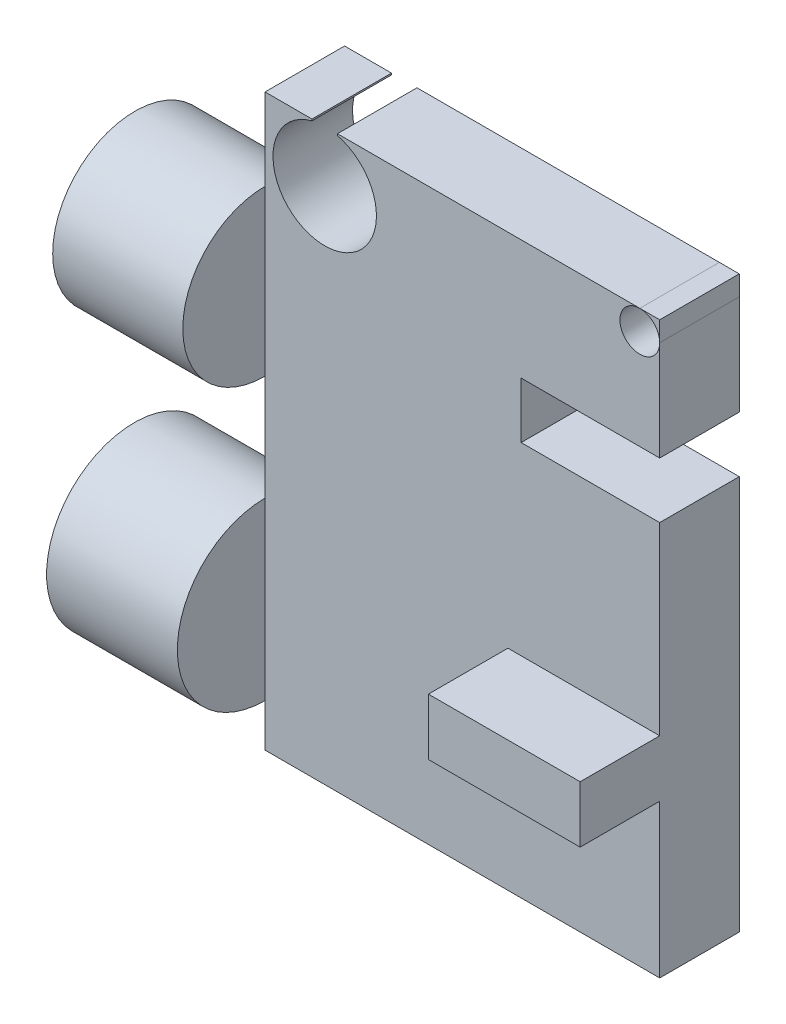
ISO-10303-21;
HEADER;
FILE_DESCRIPTION(('STEP AP214'),'2;1');
FILE_NAME('part.step','',(''),(''),'','','');
FILE_SCHEMA(('AUTOMOTIVE_DESIGN { 1 0 10303 214 1 1 1 1 }'));
ENDSEC;
DATA;
#1=APPLICATION_CONTEXT('core data for automotive mechanical design processes');
#2=APPLICATION_PROTOCOL_DEFINITION('international standard','automotive_design',2000,#1);
#3=PRODUCT_CONTEXT('',#1,'mechanical');
#4=PRODUCT('Part','Part','',(#3));
#5=PRODUCT_RELATED_PRODUCT_CATEGORY('part','',(#4));
#6=PRODUCT_DEFINITION_FORMATION('','',#4);
#7=PRODUCT_DEFINITION_CONTEXT('part definition',#1,'design');
#8=PRODUCT_DEFINITION('design','',#6,#7);
#9=PRODUCT_DEFINITION_SHAPE('','',#8);
#10=(LENGTH_UNIT() NAMED_UNIT(*) SI_UNIT(.MILLI.,.METRE.));
#11=(NAMED_UNIT(*) PLANE_ANGLE_UNIT() SI_UNIT($,.RADIAN.));
#12=(NAMED_UNIT(*) SI_UNIT($,.STERADIAN.) SOLID_ANGLE_UNIT());
#13=UNCERTAINTY_MEASURE_WITH_UNIT(LENGTH_MEASURE(1.E-05),#10,'distance_accuracy_value','');
#14=(GEOMETRIC_REPRESENTATION_CONTEXT(3) GLOBAL_UNCERTAINTY_ASSIGNED_CONTEXT((#13)) GLOBAL_UNIT_ASSIGNED_CONTEXT((#10,
#11,#12)) REPRESENTATION_CONTEXT('',''));
#15=CARTESIAN_POINT('',(0.,0.,0.));
#16=DIRECTION('',(0.,0.,1.));
#17=DIRECTION('',(1.,0.,0.));
#18=AXIS2_PLACEMENT_3D('',#15,#16,#17);
#19=CARTESIAN_POINT('',(-49.610297337926,71.6556088207095,10.));
#20=DIRECTION('',(0.,-1.,0.));
#21=DIRECTION('',(0.,0.,-1.));
#22=AXIS2_PLACEMENT_3D('',#19,#20,#21);
#23=PLANE('',#22);
#24=DIRECTION('',(0.,0.,1.));
#25=VECTOR('',#24,1.);
#26=CARTESIAN_POINT('',(-2.5,71.6556088207095,-1.02191726886024));
#27=LINE('',#26,#25);
#28=CARTESIAN_POINT('',(-2.5,71.6556088207095,0.));
#29=VERTEX_POINT('',#28);
#30=CARTESIAN_POINT('',(-2.5,71.6556088207095,10.));
#31=VERTEX_POINT('',#30);
#32=EDGE_CURVE('E187',#29,#31,#27,.T.);
#33=ORIENTED_EDGE('',*,*,#32,.F.);
#34=DIRECTION('',(-1.,0.,0.));
#35=VECTOR('',#34,1.);
#36=CARTESIAN_POINT('',(-49.610297337926,71.6556088207095,0.));
#37=LINE('',#36,#35);
#38=CARTESIAN_POINT('',(-40.5102973379259,71.6556088207095,0.));
#39=VERTEX_POINT('',#38);
#40=EDGE_CURVE('E221',#29,#39,#37,.T.);
#41=ORIENTED_EDGE('',*,*,#40,.T.);
#42=DIRECTION('',(0.,0.,1.));
#43=VECTOR('',#42,1.);
#44=CARTESIAN_POINT('',(-40.5102973379259,71.6556088207095,-1.02191726886024));
#45=LINE('',#44,#43);
#46=CARTESIAN_POINT('',(-40.5102973379259,71.6556088207095,10.));
#47=VERTEX_POINT('',#46);
#48=EDGE_CURVE('E212',#39,#47,#45,.T.);
#49=ORIENTED_EDGE('',*,*,#48,.T.);
#50=DIRECTION('',(-1.,0.,0.));
#51=VECTOR('',#50,1.);
#52=CARTESIAN_POINT('',(-49.610297337926,71.6556088207095,10.));
#53=LINE('',#52,#51);
#54=EDGE_CURVE('E211',#31,#47,#53,.T.);
#55=ORIENTED_EDGE('',*,*,#54,.F.);
#56=EDGE_LOOP('',(#33,#41,#49,#55));
#57=FACE_BOUND('',#56,.T.);
#58=ADVANCED_FACE('F51',(#57),#23,.F.);
#59=CARTESIAN_POINT('',(0.,0.,10.));
#60=DIRECTION('',(0.,0.,-1.));
#61=DIRECTION('',(-1.,0.,0.));
#62=AXIS2_PLACEMENT_3D('',#59,#60,#61);
#63=PLANE('',#62);
#64=DIRECTION('',(0.,1.,0.));
#65=VECTOR('',#64,1.);
#66=CARTESIAN_POINT('',(0.,71.6556088207095,10.));
#67=LINE('',#66,#65);
#68=CARTESIAN_POINT('',(0.,56.6036307667019,10.));
#69=VERTEX_POINT('',#68);
#70=CARTESIAN_POINT('',(0.,69.1556088207095,10.));
#71=VERTEX_POINT('',#70);
#72=EDGE_CURVE('E200',#69,#71,#67,.T.);
#73=ORIENTED_EDGE('',*,*,#72,.T.);
#74=CARTESIAN_POINT('',(-2.5,69.1556088207095,10.));
#75=DIRECTION('',(0.,0.,1.));
#76=DIRECTION('',(1.,0.,0.));
#77=AXIS2_PLACEMENT_3D('',#74,#75,#76);
#78=CIRCLE('',#77,2.5);
#79=EDGE_CURVE('E55',#31,#71,#78,.T.);
#80=ORIENTED_EDGE('',*,*,#79,.F.);
#81=ORIENTED_EDGE('',*,*,#54,.T.);
#82=DIRECTION('',(0.,1.,0.));
#83=VECTOR('',#82,1.);
#84=CARTESIAN_POINT('',(-40.5102973379259,71.6556088207095,10.));
#85=LINE('',#84,#83);
#86=CARTESIAN_POINT('',(-40.5102973379259,71.4556088207095,10.));
#87=VERTEX_POINT('',#86);
#88=EDGE_CURVE('E363',#87,#47,#85,.T.);
#89=ORIENTED_EDGE('',*,*,#88,.F.);
#90=CARTESIAN_POINT('',(-42.110297337926,65.1556088207095,10.));
#91=DIRECTION('',(0.,0.,1.));
#92=DIRECTION('',(1.,0.,0.));
#93=AXIS2_PLACEMENT_3D('',#90,#91,#92);
#94=CIRCLE('',#93,6.50000000000001);
#95=CARTESIAN_POINT('',(-43.710297337926,71.4556088207095,10.));
#96=VERTEX_POINT('',#95);
#97=EDGE_CURVE('E359',#96,#87,#94,.T.);
#98=ORIENTED_EDGE('',*,*,#97,.F.);
#99=DIRECTION('',(0.,-1.,0.));
#100=VECTOR('',#99,1.);
#101=CARTESIAN_POINT('',(-43.710297337926,71.6556088207095,10.));
#102=LINE('',#101,#100);
#103=CARTESIAN_POINT('',(-43.710297337926,71.6556088207095,10.));
#104=VERTEX_POINT('',#103);
#105=EDGE_CURVE('E354',#104,#96,#102,.T.);
#106=ORIENTED_EDGE('',*,*,#105,.F.);
#107=CARTESIAN_POINT('',(-49.610297337926,71.6556088207095,10.));
#108=VERTEX_POINT('',#107);
#109=EDGE_CURVE('E218',#104,#108,#53,.T.);
#110=ORIENTED_EDGE('',*,*,#109,.T.);
#111=DIRECTION('',(0.,-1.,0.));
#112=VECTOR('',#111,1.);
#113=CARTESIAN_POINT('',(-49.610297337926,0.,10.));
#114=LINE('',#113,#112);
#115=CARTESIAN_POINT('',(-49.610297337926,61.3830462195706,10.));
#116=VERTEX_POINT('',#115);
#117=EDGE_CURVE('E242',#108,#116,#114,.T.);
#118=ORIENTED_EDGE('',*,*,#117,.T.);
#119=CARTESIAN_POINT('',(-49.610297337926,40.7047589540983,10.));
#120=VERTEX_POINT('',#119);
#121=EDGE_CURVE('E249',#116,#120,#114,.T.);
#122=ORIENTED_EDGE('',*,*,#121,.T.);
#123=CARTESIAN_POINT('',(-49.610297337926,27.439442595116,10.));
#124=VERTEX_POINT('',#123);
#125=EDGE_CURVE('E241',#120,#124,#114,.T.);
#126=ORIENTED_EDGE('',*,*,#125,.T.);
#127=DIRECTION('',(0.,-1.,0.));
#128=VECTOR('',#127,1.);
#129=CARTESIAN_POINT('',(-49.610297337926,0.,10.));
#130=LINE('',#129,#128);
#131=CARTESIAN_POINT('',(-49.610297337926,5.3956080573955,10.));
#132=VERTEX_POINT('',#131);
#133=EDGE_CURVE('E239',#124,#132,#130,.T.);
#134=ORIENTED_EDGE('',*,*,#133,.T.);
#135=CARTESIAN_POINT('',(-49.610297337926,0.,10.));
#136=VERTEX_POINT('',#135);
#137=EDGE_CURVE('E234',#132,#136,#114,.T.);
#138=ORIENTED_EDGE('',*,*,#137,.T.);
#139=DIRECTION('',(1.,0.,0.));
#140=VECTOR('',#139,1.);
#141=CARTESIAN_POINT('',(0.,0.,10.));
#142=LINE('',#141,#140);
#143=CARTESIAN_POINT('',(0.,0.,10.));
#144=VERTEX_POINT('',#143);
#145=EDGE_CURVE('E228',#136,#144,#142,.T.);
#146=ORIENTED_EDGE('',*,*,#145,.T.);
#147=CARTESIAN_POINT('',(0.,19.246158961627,10.));
#148=VERTEX_POINT('',#147);
#149=EDGE_CURVE('E215',#144,#148,#67,.T.);
#150=ORIENTED_EDGE('',*,*,#149,.T.);
#151=DIRECTION('',(-1.,0.,0.));
#152=VECTOR('',#151,1.);
#153=CARTESIAN_POINT('',(0.,19.246158961627,10.));
#154=LINE('',#153,#152);
#155=CARTESIAN_POINT('',(-19.0764471627235,19.246158961627,10.));
#156=VERTEX_POINT('',#155);
#157=EDGE_CURVE('E226',#148,#156,#154,.T.);
#158=ORIENTED_EDGE('',*,*,#157,.T.);
#159=DIRECTION('',(0.,-1.,0.));
#160=VECTOR('',#159,1.);
#161=CARTESIAN_POINT('',(-19.0764471627235,0.,10.));
#162=LINE('',#161,#160);
#163=CARTESIAN_POINT('',(-19.0764471627235,26.3665125954924,10.));
#164=VERTEX_POINT('',#163);
#165=EDGE_CURVE('E319',#164,#156,#162,.T.);
#166=ORIENTED_EDGE('',*,*,#165,.F.);
#167=DIRECTION('',(-1.,0.,0.));
#168=VECTOR('',#167,1.);
#169=CARTESIAN_POINT('',(0.,26.3665125954924,10.));
#170=LINE('',#169,#168);
#171=CARTESIAN_POINT('',(0.,26.3665125954924,10.));
#172=VERTEX_POINT('',#171);
#173=EDGE_CURVE('E281',#172,#164,#170,.T.);
#174=ORIENTED_EDGE('',*,*,#173,.F.);
#175=CARTESIAN_POINT('',(0.,49.5808162237113,10.));
#176=VERTEX_POINT('',#175);
#177=EDGE_CURVE('E214',#172,#176,#67,.T.);
#178=ORIENTED_EDGE('',*,*,#177,.T.);
#179=DIRECTION('',(-1.,0.,0.));
#180=VECTOR('',#179,1.);
#181=CARTESIAN_POINT('',(0.,49.5808162237113,10.));
#182=LINE('',#181,#180);
#183=CARTESIAN_POINT('',(-17.4182826178507,49.5808162237113,10.));
#184=VERTEX_POINT('',#183);
#185=EDGE_CURVE('E225',#176,#184,#182,.T.);
#186=ORIENTED_EDGE('',*,*,#185,.T.);
#187=DIRECTION('',(0.,-1.,0.));
#188=VECTOR('',#187,1.);
#189=CARTESIAN_POINT('',(-17.4182826178507,0.,10.));
#190=LINE('',#189,#188);
#191=CARTESIAN_POINT('',(-17.4182826178507,56.6036307667019,10.));
#192=VERTEX_POINT('',#191);
#193=EDGE_CURVE('E282',#192,#184,#190,.T.);
#194=ORIENTED_EDGE('',*,*,#193,.F.);
#195=DIRECTION('',(-1.,0.,0.));
#196=VECTOR('',#195,1.);
#197=CARTESIAN_POINT('',(0.,56.6036307667019,10.));
#198=LINE('',#197,#196);
#199=EDGE_CURVE('E209',#69,#192,#198,.T.);
#200=ORIENTED_EDGE('',*,*,#199,.F.);
#201=EDGE_LOOP('',(#73,#80,#81,#89,#98,#106,#110,#118,#122,#126,#134,#138,#146,#150,#158,#166,
#174,#178,#186,#194,#200));
#202=FACE_BOUND('',#201,.T.);
#203=ADVANCED_FACE('F206',(#202),#63,.F.);
#204=CARTESIAN_POINT('',(0.,71.6556088207095,10.));
#205=DIRECTION('',(-1.,0.,0.));
#206=DIRECTION('',(0.,0.,1.));
#207=AXIS2_PLACEMENT_3D('',#204,#205,#206);
#208=PLANE('',#207);
#209=DIRECTION('',(0.,0.,1.));
#210=VECTOR('',#209,1.);
#211=CARTESIAN_POINT('',(0.,49.5808162237113,0.));
#212=LINE('',#211,#210);
#213=CARTESIAN_POINT('',(0.,49.5808162237113,0.));
#214=VERTEX_POINT('',#213);
#215=EDGE_CURVE('E287',#214,#176,#212,.T.);
#216=ORIENTED_EDGE('',*,*,#215,.T.);
#217=ORIENTED_EDGE('',*,*,#177,.F.);
#218=DIRECTION('',(0.,0.,-1.));
#219=VECTOR('',#218,1.);
#220=CARTESIAN_POINT('',(0.,26.3665125954924,20.));
#221=LINE('',#220,#219);
#222=CARTESIAN_POINT('',(0.,26.3665125954924,20.));
#223=VERTEX_POINT('',#222);
#224=EDGE_CURVE('E328',#223,#172,#221,.T.);
#225=ORIENTED_EDGE('',*,*,#224,.F.);
#226=DIRECTION('',(0.,1.,0.));
#227=VECTOR('',#226,1.);
#228=CARTESIAN_POINT('',(0.,0.,20.));
#229=LINE('',#228,#227);
#230=CARTESIAN_POINT('',(0.,19.246158961627,20.));
#231=VERTEX_POINT('',#230);
#232=EDGE_CURVE('E338',#231,#223,#229,.T.);
#233=ORIENTED_EDGE('',*,*,#232,.F.);
#234=DIRECTION('',(0.,0.,-1.));
#235=VECTOR('',#234,1.);
#236=CARTESIAN_POINT('',(0.,19.246158961627,20.));
#237=LINE('',#236,#235);
#238=EDGE_CURVE('E291',#231,#148,#237,.T.);
#239=ORIENTED_EDGE('',*,*,#238,.T.);
#240=ORIENTED_EDGE('',*,*,#149,.F.);
#241=DIRECTION('',(0.,0.,-1.));
#242=VECTOR('',#241,1.);
#243=CARTESIAN_POINT('',(0.,0.,10.));
#244=LINE('',#243,#242);
#245=CARTESIAN_POINT('',(0.,0.,0.));
#246=VERTEX_POINT('',#245);
#247=EDGE_CURVE('E327',#144,#246,#244,.T.);
#248=ORIENTED_EDGE('',*,*,#247,.T.);
#249=DIRECTION('',(0.,1.,0.));
#250=VECTOR('',#249,1.);
#251=CARTESIAN_POINT('',(0.,71.6556088207095,0.));
#252=LINE('',#251,#250);
#253=EDGE_CURVE('E379',#246,#214,#252,.T.);
#254=ORIENTED_EDGE('',*,*,#253,.T.);
#255=EDGE_LOOP('',(#216,#217,#225,#233,#239,#240,#248,#254));
#256=FACE_BOUND('',#255,.T.);
#257=ADVANCED_FACE('F442',(#256),#208,.F.);
#258=CARTESIAN_POINT('',(-49.610297337926,0.,10.));
#259=DIRECTION('',(1.,0.,0.));
#260=DIRECTION('',(0.,0.,-1.));
#261=AXIS2_PLACEMENT_3D('',#258,#259,#260);
#262=PLANE('',#261);
#263=DIRECTION('',(0.,-1.,0.));
#264=VECTOR('',#263,1.);
#265=CARTESIAN_POINT('',(-49.610297337926,0.,0.));
#266=LINE('',#265,#264);
#267=CARTESIAN_POINT('',(-49.610297337926,48.4175189403828,0.));
#268=VERTEX_POINT('',#267);
#269=CARTESIAN_POINT('',(-49.610297337926,21.0524644069341,0.));
#270=VERTEX_POINT('',#269);
#271=EDGE_CURVE('E270',#268,#270,#266,.T.);
#272=ORIENTED_EDGE('',*,*,#271,.T.);
#273=CARTESIAN_POINT('',(-49.610297337926,16.4175253262557,10.));
#274=DIRECTION('',(1.,0.,0.));
#275=DIRECTION('',(0.,0.,-1.));
#276=AXIS2_PLACEMENT_3D('',#273,#274,#275);
#277=CIRCLE('',#276,11.0219172688602);
#278=EDGE_CURVE('E266',#270,#124,#277,.T.);
#279=ORIENTED_EDGE('',*,*,#278,.T.);
#280=ORIENTED_EDGE('',*,*,#125,.F.);
#281=CARTESIAN_POINT('',(-49.610297337926,51.0439025868344,10.));
#282=DIRECTION('',(-1.,0.,0.));
#283=DIRECTION('',(0.,0.,1.));
#284=AXIS2_PLACEMENT_3D('',#281,#282,#283);
#285=CIRCLE('',#284,10.3391436327362);
#286=EDGE_CURVE('E262',#268,#120,#285,.T.);
#287=ORIENTED_EDGE('',*,*,#286,.F.);
#288=EDGE_LOOP('',(#272,#279,#280,#287));
#289=FACE_BOUND('',#288,.T.);
#290=ADVANCED_FACE('F487',(#289),#262,.F.);
#291=CARTESIAN_POINT('',(-49.610297337926,53.670286233286,0.));
#292=VERTEX_POINT('',#291);
#293=EDGE_CURVE('E256',#116,#292,#285,.T.);
#294=ORIENTED_EDGE('',*,*,#293,.F.);
#295=ORIENTED_EDGE('',*,*,#117,.F.);
#296=DIRECTION('',(0.,0.,-1.));
#297=VECTOR('',#296,1.);
#298=CARTESIAN_POINT('',(-49.610297337926,71.6556088207095,10.));
#299=LINE('',#298,#297);
#300=CARTESIAN_POINT('',(-49.610297337926,71.6556088207095,0.));
#301=VERTEX_POINT('',#300);
#302=EDGE_CURVE('E269',#108,#301,#299,.T.);
#303=ORIENTED_EDGE('',*,*,#302,.T.);
#304=EDGE_CURVE('E244',#301,#292,#266,.T.);
#305=ORIENTED_EDGE('',*,*,#304,.T.);
#306=EDGE_LOOP('',(#294,#295,#303,#305));
#307=FACE_BOUND('',#306,.T.);
#308=ADVANCED_FACE('F488',(#307),#262,.F.);
#309=CARTESIAN_POINT('',(0.,56.6036307667019,0.));
#310=VERTEX_POINT('',#309);
#311=CARTESIAN_POINT('',(0.,69.1556088207095,0.));
#312=VERTEX_POINT('',#311);
#313=EDGE_CURVE('E202',#310,#312,#252,.T.);
#314=ORIENTED_EDGE('',*,*,#313,.T.);
#315=DIRECTION('',(0.,0.,1.));
#316=VECTOR('',#315,1.);
#317=CARTESIAN_POINT('',(0.,69.1556088207095,-1.02191726886024));
#318=LINE('',#317,#316);
#319=EDGE_CURVE('E191',#312,#71,#318,.T.);
#320=ORIENTED_EDGE('',*,*,#319,.T.);
#321=ORIENTED_EDGE('',*,*,#72,.F.);
#322=DIRECTION('',(0.,0.,1.));
#323=VECTOR('',#322,1.);
#324=CARTESIAN_POINT('',(0.,56.6036307667019,0.));
#325=LINE('',#324,#323);
#326=EDGE_CURVE('E292',#310,#69,#325,.T.);
#327=ORIENTED_EDGE('',*,*,#326,.F.);
#328=EDGE_LOOP('',(#314,#320,#321,#327));
#329=FACE_BOUND('',#328,.T.);
#330=ADVANCED_FACE('F198',(#329),#208,.F.);
#331=ORIENTED_EDGE('',*,*,#109,.F.);
#332=DIRECTION('',(0.,0.,1.));
#333=VECTOR('',#332,1.);
#334=CARTESIAN_POINT('',(-43.710297337926,71.6556088207095,-1.02191726886024));
#335=LINE('',#334,#333);
#336=CARTESIAN_POINT('',(-43.710297337926,71.6556088207095,0.));
#337=VERTEX_POINT('',#336);
#338=EDGE_CURVE('E351',#337,#104,#335,.T.);
#339=ORIENTED_EDGE('',*,*,#338,.F.);
#340=EDGE_CURVE('E204',#337,#301,#37,.T.);
#341=ORIENTED_EDGE('',*,*,#340,.T.);
#342=ORIENTED_EDGE('',*,*,#302,.F.);
#343=EDGE_LOOP('',(#331,#339,#341,#342));
#344=FACE_BOUND('',#343,.T.);
#345=ADVANCED_FACE('F475',(#344),#23,.F.);
#346=ORIENTED_EDGE('',*,*,#137,.F.);
#347=CARTESIAN_POINT('',(-49.610297337926,11.7825862455774,0.));
#348=VERTEX_POINT('',#347);
#349=EDGE_CURVE('E387',#132,#348,#277,.T.);
#350=ORIENTED_EDGE('',*,*,#349,.T.);
#351=CARTESIAN_POINT('',(-49.610297337926,0.,0.));
#352=VERTEX_POINT('',#351);
#353=EDGE_CURVE('E395',#348,#352,#266,.T.);
#354=ORIENTED_EDGE('',*,*,#353,.T.);
#355=DIRECTION('',(0.,0.,-1.));
#356=VECTOR('',#355,1.);
#357=CARTESIAN_POINT('',(-49.610297337926,0.,10.));
#358=LINE('',#357,#356);
#359=EDGE_CURVE('E313',#136,#352,#358,.T.);
#360=ORIENTED_EDGE('',*,*,#359,.F.);
#361=EDGE_LOOP('',(#346,#350,#354,#360));
#362=FACE_BOUND('',#361,.T.);
#363=ADVANCED_FACE('F481',(#362),#262,.F.);
#364=CARTESIAN_POINT('',(0.,0.,10.));
#365=DIRECTION('',(0.,1.,0.));
#366=DIRECTION('',(0.,0.,1.));
#367=AXIS2_PLACEMENT_3D('',#364,#365,#366);
#368=PLANE('',#367);
#369=DIRECTION('',(1.,0.,0.));
#370=VECTOR('',#369,1.);
#371=CARTESIAN_POINT('',(0.,0.,0.));
#372=LINE('',#371,#370);
#373=EDGE_CURVE('E400',#352,#246,#372,.T.);
#374=ORIENTED_EDGE('',*,*,#373,.T.);
#375=ORIENTED_EDGE('',*,*,#247,.F.);
#376=ORIENTED_EDGE('',*,*,#145,.F.);
#377=ORIENTED_EDGE('',*,*,#359,.T.);
#378=EDGE_LOOP('',(#374,#375,#376,#377));
#379=FACE_BOUND('',#378,.T.);
#380=ADVANCED_FACE('F437',(#379),#368,.F.);
#381=CARTESIAN_POINT('',(0.,0.,0.));
#382=DIRECTION('',(0.,0.,-1.));
#383=DIRECTION('',(-1.,0.,0.));
#384=AXIS2_PLACEMENT_3D('',#381,#382,#383);
#385=PLANE('',#384);
#386=CARTESIAN_POINT('',(-2.5,69.1556088207095,0.));
#387=DIRECTION('',(0.,0.,-1.));
#388=DIRECTION('',(-1.,0.,0.));
#389=AXIS2_PLACEMENT_3D('',#386,#387,#388);
#390=CIRCLE('',#389,2.5);
#391=EDGE_CURVE('E12',#312,#29,#390,.T.);
#392=ORIENTED_EDGE('',*,*,#391,.F.);
#393=ORIENTED_EDGE('',*,*,#313,.F.);
#394=DIRECTION('',(-1.,0.,0.));
#395=VECTOR('',#394,1.);
#396=CARTESIAN_POINT('',(0.,56.6036307667019,0.));
#397=LINE('',#396,#395);
#398=CARTESIAN_POINT('',(-17.4182826178507,56.6036307667019,0.));
#399=VERTEX_POINT('',#398);
#400=EDGE_CURVE('E309',#310,#399,#397,.T.);
#401=ORIENTED_EDGE('',*,*,#400,.T.);
#402=DIRECTION('',(0.,-1.,0.));
#403=VECTOR('',#402,1.);
#404=CARTESIAN_POINT('',(-17.4182826178507,0.,0.));
#405=LINE('',#404,#403);
#406=CARTESIAN_POINT('',(-17.4182826178507,49.5808162237113,0.));
#407=VERTEX_POINT('',#406);
#408=EDGE_CURVE('E261',#399,#407,#405,.T.);
#409=ORIENTED_EDGE('',*,*,#408,.T.);
#410=DIRECTION('',(-1.,0.,0.));
#411=VECTOR('',#410,1.);
#412=CARTESIAN_POINT('',(0.,49.5808162237113,0.));
#413=LINE('',#412,#411);
#414=EDGE_CURVE('E286',#214,#407,#413,.T.);
#415=ORIENTED_EDGE('',*,*,#414,.F.);
#416=ORIENTED_EDGE('',*,*,#253,.F.);
#417=ORIENTED_EDGE('',*,*,#373,.F.);
#418=ORIENTED_EDGE('',*,*,#353,.F.);
#419=EDGE_CURVE('E277',#270,#348,#266,.T.);
#420=ORIENTED_EDGE('',*,*,#419,.F.);
#421=ORIENTED_EDGE('',*,*,#271,.F.);
#422=EDGE_CURVE('E254',#292,#268,#266,.T.);
#423=ORIENTED_EDGE('',*,*,#422,.F.);
#424=ORIENTED_EDGE('',*,*,#304,.F.);
#425=ORIENTED_EDGE('',*,*,#340,.F.);
#426=DIRECTION('',(0.,1.,0.));
#427=VECTOR('',#426,1.);
#428=CARTESIAN_POINT('',(-43.710297337926,0.,0.));
#429=LINE('',#428,#427);
#430=CARTESIAN_POINT('',(-43.710297337926,71.4556088207095,0.));
#431=VERTEX_POINT('',#430);
#432=EDGE_CURVE('E355',#431,#337,#429,.T.);
#433=ORIENTED_EDGE('',*,*,#432,.F.);
#434=CARTESIAN_POINT('',(-42.110297337926,65.1556088207095,0.));
#435=DIRECTION('',(0.,0.,-1.));
#436=DIRECTION('',(-1.,0.,0.));
#437=AXIS2_PLACEMENT_3D('',#434,#435,#436);
#438=CIRCLE('',#437,6.50000000000001);
#439=CARTESIAN_POINT('',(-40.5102973379259,71.4556088207095,0.));
#440=VERTEX_POINT('',#439);
#441=EDGE_CURVE('E360',#440,#431,#438,.T.);
#442=ORIENTED_EDGE('',*,*,#441,.F.);
#443=DIRECTION('',(0.,-1.,0.));
#444=VECTOR('',#443,1.);
#445=CARTESIAN_POINT('',(-40.5102973379259,0.,0.));
#446=LINE('',#445,#444);
#447=EDGE_CURVE('E341',#39,#440,#446,.T.);
#448=ORIENTED_EDGE('',*,*,#447,.F.);
#449=ORIENTED_EDGE('',*,*,#40,.F.);
#450=EDGE_LOOP('',(#392,#393,#401,#409,#415,#416,#417,#418,#420,#421,#423,#424,#425,#433,#442,
#448,#449));
#451=FACE_BOUND('',#450,.T.);
#452=ADVANCED_FACE('F444',(#451),#385,.T.);
#453=CARTESIAN_POINT('',(-49.610297337926,61.3830462195706,10.));
#454=DIRECTION('',(1.,0.,0.));
#455=DIRECTION('',(0.,0.,-1.));
#456=AXIS2_PLACEMENT_3D('',#453,#454,#455);
#457=PLANE('',#456);
#458=ORIENTED_EDGE('',*,*,#121,.F.);
#459=EDGE_CURVE('E255',#120,#116,#285,.T.);
#460=ORIENTED_EDGE('',*,*,#459,.F.);
#461=EDGE_LOOP('',(#458,#460));
#462=FACE_BOUND('',#461,.T.);
#463=ADVANCED_FACE('F516',(#462),#457,.T.);
#464=CARTESIAN_POINT('',(-65.9666450181579,51.0439025868344,10.));
#465=DIRECTION('',(-1.,0.,0.));
#466=DIRECTION('',(0.,0.,1.));
#467=AXIS2_PLACEMENT_3D('',#464,#465,#466);
#468=CYLINDRICAL_SURFACE('',#467,10.3391436327362);
#469=CARTESIAN_POINT('',(-65.9666450181579,51.0439025868344,10.));
#470=DIRECTION('',(-1.,0.,0.));
#471=DIRECTION('',(0.,0.,1.));
#472=AXIS2_PLACEMENT_3D('',#469,#470,#471);
#473=CIRCLE('',#472,10.3391436327362);
#474=CARTESIAN_POINT('',(-65.9666450181579,51.0439025868344,20.3391436327362));
#475=VERTEX_POINT('',#474);
#476=EDGE_CURVE('E250',#475,#475,#473,.T.);
#477=ORIENTED_EDGE('',*,*,#476,.F.);
#478=EDGE_LOOP('',(#477));
#479=FACE_BOUND('',#478,.T.);
#480=ORIENTED_EDGE('',*,*,#293,.T.);
#481=EDGE_CURVE('E260',#292,#268,#285,.T.);
#482=ORIENTED_EDGE('',*,*,#481,.T.);
#483=ORIENTED_EDGE('',*,*,#286,.T.);
#484=ORIENTED_EDGE('',*,*,#459,.T.);
#485=EDGE_LOOP('',(#480,#482,#483,#484));
#486=FACE_BOUND('',#485,.T.);
#487=ADVANCED_FACE('F512',(#479,#486),#468,.T.);
#488=CARTESIAN_POINT('',(-65.9666450181579,61.3830462195706,10.));
#489=DIRECTION('',(1.,0.,0.));
#490=DIRECTION('',(0.,0.,-1.));
#491=AXIS2_PLACEMENT_3D('',#488,#489,#490);
#492=PLANE('',#491);
#493=ORIENTED_EDGE('',*,*,#476,.T.);
#494=EDGE_LOOP('',(#493));
#495=FACE_BOUND('',#494,.T.);
#496=ADVANCED_FACE('F515',(#495),#492,.F.);
#497=ORIENTED_EDGE('',*,*,#481,.F.);
#498=ORIENTED_EDGE('',*,*,#422,.T.);
#499=EDGE_LOOP('',(#497,#498));
#500=FACE_BOUND('',#499,.T.);
#501=ADVANCED_FACE('F520',(#500),#457,.T.);
#502=CARTESIAN_POINT('',(-49.610297337926,27.439442595116,10.));
#503=DIRECTION('',(1.,0.,0.));
#504=DIRECTION('',(0.,0.,-1.));
#505=AXIS2_PLACEMENT_3D('',#502,#503,#504);
#506=PLANE('',#505);
#507=ORIENTED_EDGE('',*,*,#133,.F.);
#508=EDGE_CURVE('E272',#124,#132,#277,.T.);
#509=ORIENTED_EDGE('',*,*,#508,.T.);
#510=EDGE_LOOP('',(#507,#509));
#511=FACE_BOUND('',#510,.T.);
#512=ADVANCED_FACE('F501',(#511),#506,.T.);
#513=EDGE_CURVE('E271',#348,#270,#277,.T.);
#514=ORIENTED_EDGE('',*,*,#513,.T.);
#515=ORIENTED_EDGE('',*,*,#419,.T.);
#516=EDGE_LOOP('',(#514,#515));
#517=FACE_BOUND('',#516,.T.);
#518=ADVANCED_FACE('F524',(#517),#506,.T.);
#519=CARTESIAN_POINT('',(-49.610297337926,16.4175253262557,10.));
#520=DIRECTION('',(1.,0.,0.));
#521=DIRECTION('',(0.,0.,-1.));
#522=AXIS2_PLACEMENT_3D('',#519,#520,#521);
#523=CYLINDRICAL_SURFACE('',#522,11.0219172688602);
#524=CARTESIAN_POINT('',(-66.0490743156597,16.4175253262557,10.));
#525=DIRECTION('',(1.,0.,0.));
#526=DIRECTION('',(0.,0.,-1.));
#527=AXIS2_PLACEMENT_3D('',#524,#525,#526);
#528=CIRCLE('',#527,11.0219172688602);
#529=CARTESIAN_POINT('',(-66.0490743156597,16.4175253262557,-1.02191726886024));
#530=VERTEX_POINT('',#529);
#531=EDGE_CURVE('E273',#530,#530,#528,.T.);
#532=ORIENTED_EDGE('',*,*,#531,.T.);
#533=EDGE_LOOP('',(#532));
#534=FACE_BOUND('',#533,.T.);
#535=ORIENTED_EDGE('',*,*,#278,.F.);
#536=ORIENTED_EDGE('',*,*,#513,.F.);
#537=ORIENTED_EDGE('',*,*,#349,.F.);
#538=ORIENTED_EDGE('',*,*,#508,.F.);
#539=EDGE_LOOP('',(#535,#536,#537,#538));
#540=FACE_BOUND('',#539,.T.);
#541=ADVANCED_FACE('F503',(#534,#540),#523,.T.);
#542=CARTESIAN_POINT('',(-66.0490743156597,27.439442595116,10.));
#543=DIRECTION('',(-1.,0.,0.));
#544=DIRECTION('',(0.,0.,1.));
#545=AXIS2_PLACEMENT_3D('',#542,#543,#544);
#546=PLANE('',#545);
#547=ORIENTED_EDGE('',*,*,#531,.F.);
#548=EDGE_LOOP('',(#547));
#549=FACE_BOUND('',#548,.T.);
#550=ADVANCED_FACE('F529',(#549),#546,.T.);
#551=CARTESIAN_POINT('',(0.,56.6036307667019,0.));
#552=DIRECTION('',(0.,1.,0.));
#553=DIRECTION('',(0.,0.,1.));
#554=AXIS2_PLACEMENT_3D('',#551,#552,#553);
#555=PLANE('',#554);
#556=ORIENTED_EDGE('',*,*,#199,.T.);
#557=DIRECTION('',(0.,0.,1.));
#558=VECTOR('',#557,1.);
#559=CARTESIAN_POINT('',(-17.4182826178507,56.6036307667019,0.));
#560=LINE('',#559,#558);
#561=EDGE_CURVE('E278',#399,#192,#560,.T.);
#562=ORIENTED_EDGE('',*,*,#561,.F.);
#563=ORIENTED_EDGE('',*,*,#400,.F.);
#564=ORIENTED_EDGE('',*,*,#326,.T.);
#565=EDGE_LOOP('',(#556,#562,#563,#564));
#566=FACE_BOUND('',#565,.T.);
#567=ADVANCED_FACE('F533',(#566),#555,.F.);
#568=CARTESIAN_POINT('',(0.,49.5808162237113,0.));
#569=DIRECTION('',(0.,1.,0.));
#570=DIRECTION('',(0.,0.,1.));
#571=AXIS2_PLACEMENT_3D('',#568,#569,#570);
#572=PLANE('',#571);
#573=ORIENTED_EDGE('',*,*,#185,.F.);
#574=ORIENTED_EDGE('',*,*,#215,.F.);
#575=ORIENTED_EDGE('',*,*,#414,.T.);
#576=DIRECTION('',(0.,0.,1.));
#577=VECTOR('',#576,1.);
#578=CARTESIAN_POINT('',(-17.4182826178507,49.5808162237113,0.));
#579=LINE('',#578,#577);
#580=EDGE_CURVE('E283',#407,#184,#579,.T.);
#581=ORIENTED_EDGE('',*,*,#580,.T.);
#582=EDGE_LOOP('',(#573,#574,#575,#581));
#583=FACE_BOUND('',#582,.T.);
#584=ADVANCED_FACE('F448',(#583),#572,.T.);
#585=CARTESIAN_POINT('',(-17.4182826178507,0.,0.));
#586=DIRECTION('',(-1.,0.,0.));
#587=DIRECTION('',(0.,0.,1.));
#588=AXIS2_PLACEMENT_3D('',#585,#586,#587);
#589=PLANE('',#588);
#590=ORIENTED_EDGE('',*,*,#193,.T.);
#591=ORIENTED_EDGE('',*,*,#580,.F.);
#592=ORIENTED_EDGE('',*,*,#408,.F.);
#593=ORIENTED_EDGE('',*,*,#561,.T.);
#594=EDGE_LOOP('',(#590,#591,#592,#593));
#595=FACE_BOUND('',#594,.T.);
#596=ADVANCED_FACE('F472',(#595),#589,.F.);
#597=CARTESIAN_POINT('',(0.,26.3665125954924,20.));
#598=DIRECTION('',(0.,-1.,0.));
#599=DIRECTION('',(0.,0.,-1.));
#600=AXIS2_PLACEMENT_3D('',#597,#598,#599);
#601=PLANE('',#600);
#602=ORIENTED_EDGE('',*,*,#173,.T.);
#603=DIRECTION('',(0.,0.,-1.));
#604=VECTOR('',#603,1.);
#605=CARTESIAN_POINT('',(-19.0764471627235,26.3665125954924,20.));
#606=LINE('',#605,#604);
#607=CARTESIAN_POINT('',(-19.0764471627235,26.3665125954924,20.));
#608=VERTEX_POINT('',#607);
#609=EDGE_CURVE('E314',#608,#164,#606,.T.);
#610=ORIENTED_EDGE('',*,*,#609,.F.);
#611=DIRECTION('',(-1.,0.,0.));
#612=VECTOR('',#611,1.);
#613=CARTESIAN_POINT('',(0.,26.3665125954924,20.));
#614=LINE('',#613,#612);
#615=EDGE_CURVE('E324',#223,#608,#614,.T.);
#616=ORIENTED_EDGE('',*,*,#615,.F.);
#617=ORIENTED_EDGE('',*,*,#224,.T.);
#618=EDGE_LOOP('',(#602,#610,#616,#617));
#619=FACE_BOUND('',#618,.T.);
#620=ADVANCED_FACE('F455',(#619),#601,.F.);
#621=CARTESIAN_POINT('',(-19.0764471627235,0.,20.));
#622=DIRECTION('',(1.,0.,0.));
#623=DIRECTION('',(0.,0.,-1.));
#624=AXIS2_PLACEMENT_3D('',#621,#622,#623);
#625=PLANE('',#624);
#626=ORIENTED_EDGE('',*,*,#165,.T.);
#627=DIRECTION('',(0.,0.,-1.));
#628=VECTOR('',#627,1.);
#629=CARTESIAN_POINT('',(-19.0764471627235,19.246158961627,20.));
#630=LINE('',#629,#628);
#631=CARTESIAN_POINT('',(-19.0764471627235,19.246158961627,20.));
#632=VERTEX_POINT('',#631);
#633=EDGE_CURVE('E320',#632,#156,#630,.T.);
#634=ORIENTED_EDGE('',*,*,#633,.F.);
#635=DIRECTION('',(0.,-1.,0.));
#636=VECTOR('',#635,1.);
#637=CARTESIAN_POINT('',(-19.0764471627235,0.,20.));
#638=LINE('',#637,#636);
#639=EDGE_CURVE('E342',#608,#632,#638,.T.);
#640=ORIENTED_EDGE('',*,*,#639,.F.);
#641=ORIENTED_EDGE('',*,*,#609,.T.);
#642=EDGE_LOOP('',(#626,#634,#640,#641));
#643=FACE_BOUND('',#642,.T.);
#644=ADVANCED_FACE('F464',(#643),#625,.F.);
#645=CARTESIAN_POINT('',(0.,19.246158961627,20.));
#646=DIRECTION('',(0.,-1.,0.));
#647=DIRECTION('',(0.,0.,-1.));
#648=AXIS2_PLACEMENT_3D('',#645,#646,#647);
#649=PLANE('',#648);
#650=ORIENTED_EDGE('',*,*,#157,.F.);
#651=ORIENTED_EDGE('',*,*,#238,.F.);
#652=DIRECTION('',(-1.,0.,0.));
#653=VECTOR('',#652,1.);
#654=CARTESIAN_POINT('',(0.,19.246158961627,20.));
#655=LINE('',#654,#653);
#656=EDGE_CURVE('E318',#231,#632,#655,.T.);
#657=ORIENTED_EDGE('',*,*,#656,.T.);
#658=ORIENTED_EDGE('',*,*,#633,.T.);
#659=EDGE_LOOP('',(#650,#651,#657,#658));
#660=FACE_BOUND('',#659,.T.);
#661=ADVANCED_FACE('F462',(#660),#649,.T.);
#662=CARTESIAN_POINT('',(0.,0.,20.));
#663=DIRECTION('',(0.,0.,1.));
#664=DIRECTION('',(1.,0.,0.));
#665=AXIS2_PLACEMENT_3D('',#662,#663,#664);
#666=PLANE('',#665);
#667=ORIENTED_EDGE('',*,*,#615,.T.);
#668=ORIENTED_EDGE('',*,*,#639,.T.);
#669=ORIENTED_EDGE('',*,*,#656,.F.);
#670=ORIENTED_EDGE('',*,*,#232,.T.);
#671=EDGE_LOOP('',(#667,#668,#669,#670));
#672=FACE_BOUND('',#671,.T.);
#673=ADVANCED_FACE('F457',(#672),#666,.T.);
#674=CARTESIAN_POINT('',(-40.5102973379259,71.6556088207095,-1.02191726886024));
#675=DIRECTION('',(1.,0.,0.));
#676=DIRECTION('',(0.,0.,-1.));
#677=AXIS2_PLACEMENT_3D('',#674,#675,#676);
#678=PLANE('',#677);
#679=ORIENTED_EDGE('',*,*,#447,.T.);
#680=DIRECTION('',(0.,0.,1.));
#681=VECTOR('',#680,1.);
#682=CARTESIAN_POINT('',(-40.5102973379259,71.4556088207095,-1.02191726886024));
#683=LINE('',#682,#681);
#684=EDGE_CURVE('E361',#440,#87,#683,.T.);
#685=ORIENTED_EDGE('',*,*,#684,.T.);
#686=ORIENTED_EDGE('',*,*,#88,.T.);
#687=ORIENTED_EDGE('',*,*,#48,.F.);
#688=EDGE_LOOP('',(#679,#685,#686,#687));
#689=FACE_BOUND('',#688,.T.);
#690=ADVANCED_FACE('F573',(#689),#678,.F.);
#691=CARTESIAN_POINT('',(-42.110297337926,65.1556088207095,-1.02191726886024));
#692=DIRECTION('',(0.,0.,1.));
#693=DIRECTION('',(1.,0.,0.));
#694=AXIS2_PLACEMENT_3D('',#691,#692,#693);
#695=CYLINDRICAL_SURFACE('',#694,6.50000000000001);
#696=ORIENTED_EDGE('',*,*,#441,.T.);
#697=DIRECTION('',(0.,0.,1.));
#698=VECTOR('',#697,1.);
#699=CARTESIAN_POINT('',(-43.710297337926,71.4556088207095,-1.02191726886024));
#700=LINE('',#699,#698);
#701=EDGE_CURVE('E356',#431,#96,#700,.T.);
#702=ORIENTED_EDGE('',*,*,#701,.T.);
#703=ORIENTED_EDGE('',*,*,#97,.T.);
#704=ORIENTED_EDGE('',*,*,#684,.F.);
#705=EDGE_LOOP('',(#696,#702,#703,#704));
#706=FACE_BOUND('',#705,.T.);
#707=ADVANCED_FACE('F582',(#706),#695,.F.);
#708=CARTESIAN_POINT('',(-43.710297337926,71.6556088207095,-1.02191726886024));
#709=DIRECTION('',(-1.,0.,0.));
#710=DIRECTION('',(0.,0.,1.));
#711=AXIS2_PLACEMENT_3D('',#708,#709,#710);
#712=PLANE('',#711);
#713=ORIENTED_EDGE('',*,*,#432,.T.);
#714=ORIENTED_EDGE('',*,*,#338,.T.);
#715=ORIENTED_EDGE('',*,*,#105,.T.);
#716=ORIENTED_EDGE('',*,*,#701,.F.);
#717=EDGE_LOOP('',(#713,#714,#715,#716));
#718=FACE_BOUND('',#717,.T.);
#719=ADVANCED_FACE('F592',(#718),#712,.F.);
#720=CARTESIAN_POINT('',(-2.5,69.1556088207095,-1.02191726886024));
#721=DIRECTION('',(0.,0.,1.));
#722=DIRECTION('',(1.,0.,0.));
#723=AXIS2_PLACEMENT_3D('',#720,#721,#722);
#724=CYLINDRICAL_SURFACE('',#723,2.5);
#725=ORIENTED_EDGE('',*,*,#32,.T.);
#726=ORIENTED_EDGE('',*,*,#79,.T.);
#727=ORIENTED_EDGE('',*,*,#319,.F.);
#728=ORIENTED_EDGE('',*,*,#391,.T.);
#729=EDGE_LOOP('',(#725,#726,#727,#728));
#730=FACE_BOUND('',#729,.T.);
#731=ADVANCED_FACE('F53',(#730),#724,.F.);
#732=CLOSED_SHELL('',(#58,#203,#257,#290,#308,#330,#345,#363,#380,#452,#463,#487,#496,#501,#512,
#518,#541,#550,#567,#584,#596,#620,#644,#661,#673,#690,#707,#719,#731));
#733=MANIFOLD_SOLID_BREP('B2',#732);
#734=CARTESIAN_POINT('',(0.,0.,0.));
#735=DIRECTION('',(0.,0.,-1.));
#736=DIRECTION('',(-1.,0.,0.));
#737=AXIS2_PLACEMENT_3D('',#734,#735,#736);
#738=PLANE('',#737);
#739=CARTESIAN_POINT('',(-2.5,69.1556088207095,0.));
#740=DIRECTION('',(0.,0.,-1.));
#741=DIRECTION('',(-1.,0.,0.));
#742=AXIS2_PLACEMENT_3D('',#739,#740,#741);
#743=CIRCLE('',#742,2.5);
#744=CARTESIAN_POINT('',(-2.5,71.6556088207095,0.));
#745=VERTEX_POINT('',#744);
#746=CARTESIAN_POINT('',(0.,69.1556088207095,0.));
#747=VERTEX_POINT('',#746);
#748=EDGE_CURVE('E49',#745,#747,#743,.T.);
#749=ORIENTED_EDGE('',*,*,#748,.F.);
#750=DIRECTION('',(-1.,0.,0.));
#751=VECTOR('',#750,1.);
#752=CARTESIAN_POINT('',(-49.610297337926,71.6556088207095,0.));
#753=LINE('',#752,#751);
#754=CARTESIAN_POINT('',(0.,71.6556088207095,0.));
#755=VERTEX_POINT('',#754);
#756=EDGE_CURVE('E797',#755,#745,#753,.T.);
#757=ORIENTED_EDGE('',*,*,#756,.F.);
#758=DIRECTION('',(0.,1.,0.));
#759=VECTOR('',#758,1.);
#760=CARTESIAN_POINT('',(0.,71.6556088207095,0.));
#761=LINE('',#760,#759);
#762=EDGE_CURVE('E799',#747,#755,#761,.T.);
#763=ORIENTED_EDGE('',*,*,#762,.F.);
#764=EDGE_LOOP('',(#749,#757,#763));
#765=FACE_BOUND('',#764,.T.);
#766=ADVANCED_FACE('F754',(#765),#738,.T.);
#767=CARTESIAN_POINT('',(0.,71.6556088207095,10.));
#768=DIRECTION('',(-1.,0.,0.));
#769=DIRECTION('',(0.,0.,1.));
#770=AXIS2_PLACEMENT_3D('',#767,#768,#769);
#771=PLANE('',#770);
#772=DIRECTION('',(0.,0.,1.));
#773=VECTOR('',#772,1.);
#774=CARTESIAN_POINT('',(0.,69.1556088207095,-1.02191726886024));
#775=LINE('',#774,#773);
#776=CARTESIAN_POINT('',(0.,69.1556088207095,10.));
#777=VERTEX_POINT('',#776);
#778=EDGE_CURVE('E768',#747,#777,#775,.T.);
#779=ORIENTED_EDGE('',*,*,#778,.F.);
#780=ORIENTED_EDGE('',*,*,#762,.T.);
#781=DIRECTION('',(0.,0.,-1.));
#782=VECTOR('',#781,1.);
#783=CARTESIAN_POINT('',(0.,71.6556088207095,10.));
#784=LINE('',#783,#782);
#785=CARTESIAN_POINT('',(0.,71.6556088207095,10.));
#786=VERTEX_POINT('',#785);
#787=EDGE_CURVE('E762',#786,#755,#784,.T.);
#788=ORIENTED_EDGE('',*,*,#787,.F.);
#789=DIRECTION('',(0.,1.,0.));
#790=VECTOR('',#789,1.);
#791=CARTESIAN_POINT('',(0.,71.6556088207095,10.));
#792=LINE('',#791,#790);
#793=EDGE_CURVE('E802',#777,#786,#792,.T.);
#794=ORIENTED_EDGE('',*,*,#793,.F.);
#795=EDGE_LOOP('',(#779,#780,#788,#794));
#796=FACE_BOUND('',#795,.T.);
#797=ADVANCED_FACE('F756',(#796),#771,.F.);
#798=CARTESIAN_POINT('',(0.,0.,10.));
#799=DIRECTION('',(0.,0.,-1.));
#800=DIRECTION('',(-1.,0.,0.));
#801=AXIS2_PLACEMENT_3D('',#798,#799,#800);
#802=PLANE('',#801);
#803=DIRECTION('',(-1.,0.,0.));
#804=VECTOR('',#803,1.);
#805=CARTESIAN_POINT('',(-49.610297337926,71.6556088207095,10.));
#806=LINE('',#805,#804);
#807=CARTESIAN_POINT('',(-2.5,71.6556088207095,10.));
#808=VERTEX_POINT('',#807);
#809=EDGE_CURVE('E794',#786,#808,#806,.T.);
#810=ORIENTED_EDGE('',*,*,#809,.T.);
#811=CARTESIAN_POINT('',(-2.5,69.1556088207095,10.));
#812=DIRECTION('',(0.,0.,1.));
#813=DIRECTION('',(1.,0.,0.));
#814=AXIS2_PLACEMENT_3D('',#811,#812,#813);
#815=CIRCLE('',#814,2.5);
#816=EDGE_CURVE('E785',#777,#808,#815,.T.);
#817=ORIENTED_EDGE('',*,*,#816,.F.);
#818=ORIENTED_EDGE('',*,*,#793,.T.);
#819=EDGE_LOOP('',(#810,#817,#818));
#820=FACE_BOUND('',#819,.T.);
#821=ADVANCED_FACE('F801',(#820),#802,.F.);
#822=CARTESIAN_POINT('',(-49.610297337926,71.6556088207095,10.));
#823=DIRECTION('',(0.,-1.,0.));
#824=DIRECTION('',(0.,0.,-1.));
#825=AXIS2_PLACEMENT_3D('',#822,#823,#824);
#826=PLANE('',#825);
#827=ORIENTED_EDGE('',*,*,#756,.T.);
#828=DIRECTION('',(0.,0.,1.));
#829=VECTOR('',#828,1.);
#830=CARTESIAN_POINT('',(-2.5,71.6556088207095,-1.02191726886024));
#831=LINE('',#830,#829);
#832=EDGE_CURVE('E773',#745,#808,#831,.T.);
#833=ORIENTED_EDGE('',*,*,#832,.T.);
#834=ORIENTED_EDGE('',*,*,#809,.F.);
#835=ORIENTED_EDGE('',*,*,#787,.T.);
#836=EDGE_LOOP('',(#827,#833,#834,#835));
#837=FACE_BOUND('',#836,.T.);
#838=ADVANCED_FACE('F792',(#837),#826,.F.);
#839=CARTESIAN_POINT('',(-2.5,69.1556088207095,-1.02191726886024));
#840=DIRECTION('',(0.,0.,1.));
#841=DIRECTION('',(1.,0.,0.));
#842=AXIS2_PLACEMENT_3D('',#839,#840,#841);
#843=CYLINDRICAL_SURFACE('',#842,2.5);
#844=ORIENTED_EDGE('',*,*,#748,.T.);
#845=ORIENTED_EDGE('',*,*,#778,.T.);
#846=ORIENTED_EDGE('',*,*,#816,.T.);
#847=ORIENTED_EDGE('',*,*,#832,.F.);
#848=EDGE_LOOP('',(#844,#845,#846,#847));
#849=FACE_BOUND('',#848,.T.);
#850=ADVANCED_FACE('F786',(#849),#843,.F.);
#851=CLOSED_SHELL('',(#766,#797,#821,#838,#850));
#852=MANIFOLD_SOLID_BREP('B6',#851);
#853=ADVANCED_BREP_SHAPE_REPRESENTATION('',(#18,#733,#852),#14);
#854=SHAPE_DEFINITION_REPRESENTATION(#9,#853);
ENDSEC;
END-ISO-10303-21;
